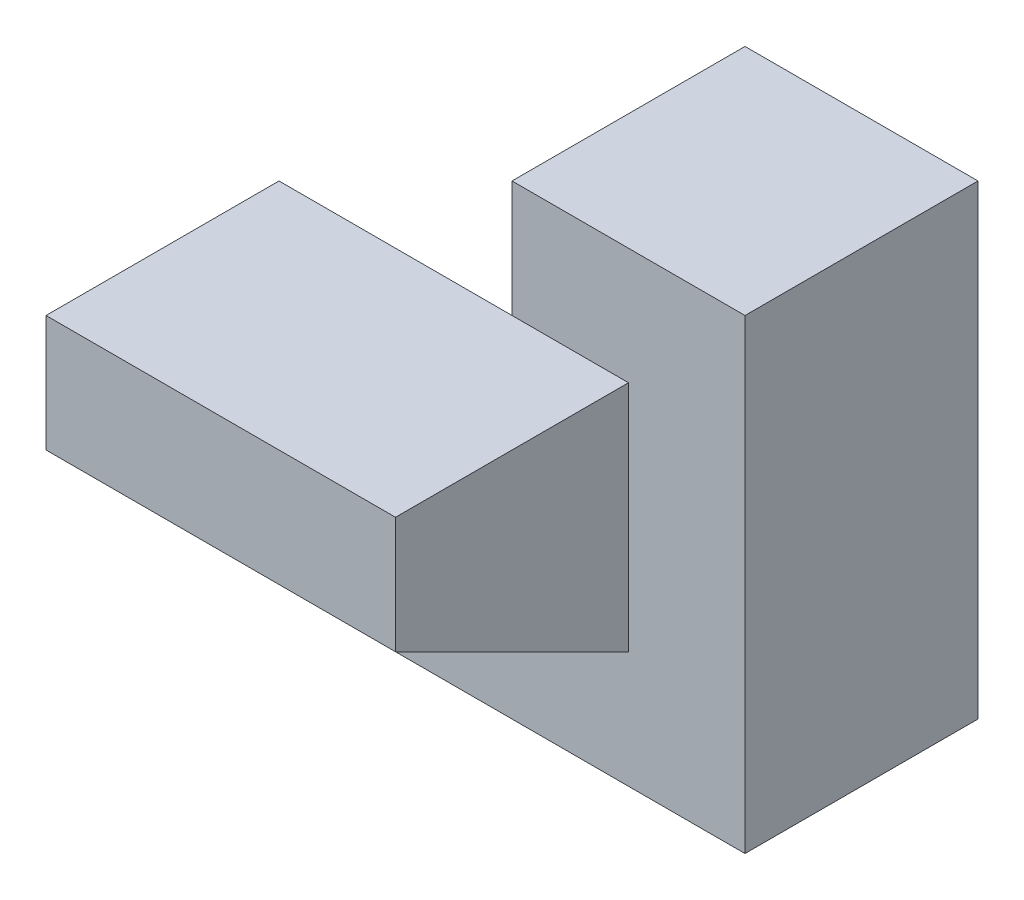
ISO-10303-21;
HEADER;
FILE_DESCRIPTION(('STEP AP214'),'2;1');
FILE_NAME('part.step','',(''),(''),'','','');
FILE_SCHEMA(('AUTOMOTIVE_DESIGN { 1 0 10303 214 1 1 1 1 }'));
ENDSEC;
DATA;
#1=APPLICATION_CONTEXT('core data for automotive mechanical design processes');
#2=APPLICATION_PROTOCOL_DEFINITION('international standard','automotive_design',2000,#1);
#3=PRODUCT_CONTEXT('',#1,'mechanical');
#4=PRODUCT('Part','Part','',(#3));
#5=PRODUCT_RELATED_PRODUCT_CATEGORY('part','',(#4));
#6=PRODUCT_DEFINITION_FORMATION('','',#4);
#7=PRODUCT_DEFINITION_CONTEXT('part definition',#1,'design');
#8=PRODUCT_DEFINITION('design','',#6,#7);
#9=PRODUCT_DEFINITION_SHAPE('','',#8);
#10=(LENGTH_UNIT() NAMED_UNIT(*) SI_UNIT(.MILLI.,.METRE.));
#11=(NAMED_UNIT(*) PLANE_ANGLE_UNIT() SI_UNIT($,.RADIAN.));
#12=(NAMED_UNIT(*) SI_UNIT($,.STERADIAN.) SOLID_ANGLE_UNIT());
#13=UNCERTAINTY_MEASURE_WITH_UNIT(LENGTH_MEASURE(1.E-05),#10,'distance_accuracy_value','');
#14=(GEOMETRIC_REPRESENTATION_CONTEXT(3) GLOBAL_UNCERTAINTY_ASSIGNED_CONTEXT((#13)) GLOBAL_UNIT_ASSIGNED_CONTEXT((#10,
#11,#12)) REPRESENTATION_CONTEXT('',''));
#15=CARTESIAN_POINT('',(0.,0.,0.));
#16=DIRECTION('',(0.,0.,1.));
#17=DIRECTION('',(1.,0.,0.));
#18=AXIS2_PLACEMENT_3D('',#15,#16,#17);
#19=CARTESIAN_POINT('',(2.,0.,0.));
#20=DIRECTION('',(0.,0.,-1.));
#21=DIRECTION('',(-1.,0.,0.));
#22=AXIS2_PLACEMENT_3D('',#19,#20,#21);
#23=PLANE('',#22);
#24=DIRECTION('',(0.,-1.,0.));
#25=VECTOR('',#24,1.);
#26=CARTESIAN_POINT('',(0.,0.,0.));
#27=LINE('',#26,#25);
#28=CARTESIAN_POINT('',(0.,4.,0.));
#29=VERTEX_POINT('',#28);
#30=CARTESIAN_POINT('',(0.,3.,0.));
#31=VERTEX_POINT('',#30);
#32=EDGE_CURVE('E104',#29,#31,#27,.T.);
#33=ORIENTED_EDGE('',*,*,#32,.T.);
#34=DIRECTION('',(-1.,0.,0.));
#35=VECTOR('',#34,1.);
#36=CARTESIAN_POINT('',(1.,3.,0.));
#37=LINE('',#36,#35);
#38=CARTESIAN_POINT('',(1.,3.,0.));
#39=VERTEX_POINT('',#38);
#40=EDGE_CURVE('E155',#39,#31,#37,.T.);
#41=ORIENTED_EDGE('',*,*,#40,.F.);
#42=DIRECTION('',(0.,1.,0.));
#43=VECTOR('',#42,1.);
#44=CARTESIAN_POINT('',(1.,0.,0.));
#45=LINE('',#44,#43);
#46=CARTESIAN_POINT('',(1.,1.,0.));
#47=VERTEX_POINT('',#46);
#48=EDGE_CURVE('E107',#47,#39,#45,.T.);
#49=ORIENTED_EDGE('',*,*,#48,.F.);
#50=DIRECTION('',(-1.,0.,0.));
#51=VECTOR('',#50,1.);
#52=CARTESIAN_POINT('',(1.,1.,0.));
#53=LINE('',#52,#51);
#54=CARTESIAN_POINT('',(-2.,1.,0.));
#55=VERTEX_POINT('',#54);
#56=EDGE_CURVE('E126',#47,#55,#53,.T.);
#57=ORIENTED_EDGE('',*,*,#56,.T.);
#58=DIRECTION('',(0.,1.,0.));
#59=VECTOR('',#58,1.);
#60=CARTESIAN_POINT('',(-2.,1.,0.));
#61=LINE('',#60,#59);
#62=CARTESIAN_POINT('',(-2.,0.,0.));
#63=VERTEX_POINT('',#62);
#64=EDGE_CURVE('E123',#63,#55,#61,.T.);
#65=ORIENTED_EDGE('',*,*,#64,.F.);
#66=DIRECTION('',(-1.,0.,0.));
#67=VECTOR('',#66,1.);
#68=CARTESIAN_POINT('',(2.,0.,0.));
#69=LINE('',#68,#67);
#70=CARTESIAN_POINT('',(2.,0.,0.));
#71=VERTEX_POINT('',#70);
#72=EDGE_CURVE('E41',#71,#63,#69,.T.);
#73=ORIENTED_EDGE('',*,*,#72,.F.);
#74=DIRECTION('',(0.,-1.,0.));
#75=VECTOR('',#74,1.);
#76=CARTESIAN_POINT('',(2.,0.,0.));
#77=LINE('',#76,#75);
#78=CARTESIAN_POINT('',(2.,4.,0.));
#79=VERTEX_POINT('',#78);
#80=EDGE_CURVE('E85',#79,#71,#77,.T.);
#81=ORIENTED_EDGE('',*,*,#80,.F.);
#82=DIRECTION('',(-1.,0.,0.));
#83=VECTOR('',#82,1.);
#84=CARTESIAN_POINT('',(2.,4.,0.));
#85=LINE('',#84,#83);
#86=EDGE_CURVE('E100',#79,#29,#85,.T.);
#87=ORIENTED_EDGE('',*,*,#86,.T.);
#88=EDGE_LOOP('',(#33,#41,#49,#57,#65,#73,#81,#87));
#89=FACE_BOUND('',#88,.T.);
#90=ADVANCED_FACE('F33',(#89),#23,.F.);
#91=CARTESIAN_POINT('',(2.,0.,0.));
#92=DIRECTION('',(0.,1.,0.));
#93=DIRECTION('',(0.,0.,1.));
#94=AXIS2_PLACEMENT_3D('',#91,#92,#93);
#95=PLANE('',#94);
#96=DIRECTION('',(-1.,0.,0.));
#97=VECTOR('',#96,1.);
#98=CARTESIAN_POINT('',(1.,0.,-2.));
#99=LINE('',#98,#97);
#100=CARTESIAN_POINT('',(0.,0.,-2.));
#101=VERTEX_POINT('',#100);
#102=CARTESIAN_POINT('',(-2.,0.,-2.));
#103=VERTEX_POINT('',#102);
#104=EDGE_CURVE('E95',#101,#103,#99,.T.);
#105=ORIENTED_EDGE('',*,*,#104,.F.);
#106=DIRECTION('',(-1.,0.,0.));
#107=VECTOR('',#106,1.);
#108=CARTESIAN_POINT('',(2.,0.,-2.));
#109=LINE('',#108,#107);
#110=CARTESIAN_POINT('',(2.,0.,-2.));
#111=VERTEX_POINT('',#110);
#112=EDGE_CURVE('E91',#111,#101,#109,.T.);
#113=ORIENTED_EDGE('',*,*,#112,.F.);
#114=DIRECTION('',(0.,0.,-1.));
#115=VECTOR('',#114,1.);
#116=CARTESIAN_POINT('',(2.,0.,0.));
#117=LINE('',#116,#115);
#118=EDGE_CURVE('E79',#71,#111,#117,.T.);
#119=ORIENTED_EDGE('',*,*,#118,.F.);
#120=ORIENTED_EDGE('',*,*,#72,.T.);
#121=DIRECTION('',(0.,0.,1.));
#122=VECTOR('',#121,1.);
#123=CARTESIAN_POINT('',(-2.,0.,0.));
#124=LINE('',#123,#122);
#125=EDGE_CURVE('E117',#103,#63,#124,.T.);
#126=ORIENTED_EDGE('',*,*,#125,.F.);
#127=EDGE_LOOP('',(#105,#113,#119,#120,#126));
#128=FACE_BOUND('',#127,.T.);
#129=ADVANCED_FACE('F92',(#128),#95,.F.);
#130=CARTESIAN_POINT('',(2.,0.,-2.));
#131=DIRECTION('',(0.,0.,1.));
#132=DIRECTION('',(1.,0.,0.));
#133=AXIS2_PLACEMENT_3D('',#130,#131,#132);
#134=PLANE('',#133);
#135=DIRECTION('',(0.,1.,0.));
#136=VECTOR('',#135,1.);
#137=CARTESIAN_POINT('',(0.,0.,-2.));
#138=LINE('',#137,#136);
#139=CARTESIAN_POINT('',(0.,4.,-2.));
#140=VERTEX_POINT('',#139);
#141=EDGE_CURVE('E61',#101,#140,#138,.T.);
#142=ORIENTED_EDGE('',*,*,#141,.T.);
#143=DIRECTION('',(-1.,0.,0.));
#144=VECTOR('',#143,1.);
#145=CARTESIAN_POINT('',(2.,4.,-2.));
#146=LINE('',#145,#144);
#147=CARTESIAN_POINT('',(2.,4.,-2.));
#148=VERTEX_POINT('',#147);
#149=EDGE_CURVE('E96',#148,#140,#146,.T.);
#150=ORIENTED_EDGE('',*,*,#149,.F.);
#151=DIRECTION('',(0.,1.,0.));
#152=VECTOR('',#151,1.);
#153=CARTESIAN_POINT('',(2.,0.,-2.));
#154=LINE('',#153,#152);
#155=EDGE_CURVE('E83',#111,#148,#154,.T.);
#156=ORIENTED_EDGE('',*,*,#155,.F.);
#157=ORIENTED_EDGE('',*,*,#112,.T.);
#158=EDGE_LOOP('',(#142,#150,#156,#157));
#159=FACE_BOUND('',#158,.T.);
#160=ADVANCED_FACE('F98',(#159),#134,.F.);
#161=CARTESIAN_POINT('',(2.,4.,0.));
#162=DIRECTION('',(0.,-1.,0.));
#163=DIRECTION('',(0.,0.,-1.));
#164=AXIS2_PLACEMENT_3D('',#161,#162,#163);
#165=PLANE('',#164);
#166=DIRECTION('',(0.,0.,1.));
#167=VECTOR('',#166,1.);
#168=CARTESIAN_POINT('',(0.,4.,0.));
#169=LINE('',#168,#167);
#170=EDGE_CURVE('E109',#140,#29,#169,.T.);
#171=ORIENTED_EDGE('',*,*,#170,.T.);
#172=ORIENTED_EDGE('',*,*,#86,.F.);
#173=DIRECTION('',(0.,0.,1.));
#174=VECTOR('',#173,1.);
#175=CARTESIAN_POINT('',(2.,4.,0.));
#176=LINE('',#175,#174);
#177=EDGE_CURVE('E49',#148,#79,#176,.T.);
#178=ORIENTED_EDGE('',*,*,#177,.F.);
#179=ORIENTED_EDGE('',*,*,#149,.T.);
#180=EDGE_LOOP('',(#171,#172,#178,#179));
#181=FACE_BOUND('',#180,.T.);
#182=ADVANCED_FACE('F217',(#181),#165,.F.);
#183=CARTESIAN_POINT('',(2.,0.,0.));
#184=DIRECTION('',(-1.,0.,0.));
#185=DIRECTION('',(0.,0.,1.));
#186=AXIS2_PLACEMENT_3D('',#183,#184,#185);
#187=PLANE('',#186);
#188=ORIENTED_EDGE('',*,*,#80,.T.);
#189=ORIENTED_EDGE('',*,*,#118,.T.);
#190=ORIENTED_EDGE('',*,*,#155,.T.);
#191=ORIENTED_EDGE('',*,*,#177,.T.);
#192=EDGE_LOOP('',(#188,#189,#190,#191));
#193=FACE_BOUND('',#192,.T.);
#194=ADVANCED_FACE('F81',(#193),#187,.F.);
#195=CARTESIAN_POINT('',(0.,0.,0.));
#196=DIRECTION('',(-1.,0.,0.));
#197=DIRECTION('',(0.,0.,1.));
#198=AXIS2_PLACEMENT_3D('',#195,#196,#197);
#199=PLANE('',#198);
#200=DIRECTION('',(0.,-0.832050294337844,-0.554700196225229));
#201=VECTOR('',#200,1.);
#202=CARTESIAN_POINT('',(0.,0.923076923076923,-1.38461538461539));
#203=LINE('',#202,#201);
#204=EDGE_CURVE('E11',#31,#101,#203,.T.);
#205=ORIENTED_EDGE('',*,*,#204,.F.);
#206=ORIENTED_EDGE('',*,*,#32,.F.);
#207=ORIENTED_EDGE('',*,*,#170,.F.);
#208=ORIENTED_EDGE('',*,*,#141,.F.);
#209=EDGE_LOOP('',(#205,#206,#207,#208));
#210=FACE_BOUND('',#209,.T.);
#211=ADVANCED_FACE('F181',(#210),#199,.T.);
#212=CARTESIAN_POINT('',(1.,0.,0.));
#213=DIRECTION('',(-1.,0.,0.));
#214=DIRECTION('',(0.,0.,1.));
#215=AXIS2_PLACEMENT_3D('',#212,#213,#214);
#216=PLANE('',#215);
#217=DIRECTION('',(0.,0.447213595499958,0.894427190999916));
#218=VECTOR('',#217,1.);
#219=CARTESIAN_POINT('',(1.,2.,2.));
#220=LINE('',#219,#218);
#221=CARTESIAN_POINT('',(1.,2.,2.));
#222=VERTEX_POINT('',#221);
#223=EDGE_CURVE('E145',#47,#222,#220,.T.);
#224=ORIENTED_EDGE('',*,*,#223,.F.);
#225=ORIENTED_EDGE('',*,*,#48,.T.);
#226=DIRECTION('',(0.,0.,-1.));
#227=VECTOR('',#226,1.);
#228=CARTESIAN_POINT('',(1.,3.,0.));
#229=LINE('',#228,#227);
#230=CARTESIAN_POINT('',(1.,3.,2.));
#231=VERTEX_POINT('',#230);
#232=EDGE_CURVE('E151',#231,#39,#229,.T.);
#233=ORIENTED_EDGE('',*,*,#232,.F.);
#234=DIRECTION('',(0.,1.,0.));
#235=VECTOR('',#234,1.);
#236=CARTESIAN_POINT('',(1.,3.,2.));
#237=LINE('',#236,#235);
#238=EDGE_CURVE('E148',#222,#231,#237,.T.);
#239=ORIENTED_EDGE('',*,*,#238,.F.);
#240=EDGE_LOOP('',(#224,#225,#233,#239));
#241=FACE_BOUND('',#240,.T.);
#242=ADVANCED_FACE('F168',(#241),#216,.F.);
#243=CARTESIAN_POINT('',(1.,0.,-2.));
#244=DIRECTION('',(0.,0.554700196225229,-0.832050294337844));
#245=DIRECTION('',(0.,0.832050294337844,0.554700196225229));
#246=AXIS2_PLACEMENT_3D('',#243,#244,#245);
#247=PLANE('',#246);
#248=CARTESIAN_POINT('',(-2.,3.,0.));
#249=VERTEX_POINT('',#248);
#250=EDGE_CURVE('E71',#31,#249,#37,.T.);
#251=ORIENTED_EDGE('',*,*,#250,.F.);
#252=ORIENTED_EDGE('',*,*,#204,.T.);
#253=ORIENTED_EDGE('',*,*,#104,.T.);
#254=DIRECTION('',(0.,-0.832050294337844,-0.554700196225229));
#255=VECTOR('',#254,1.);
#256=CARTESIAN_POINT('',(-2.,0.,-2.));
#257=LINE('',#256,#255);
#258=EDGE_CURVE('E135',#249,#103,#257,.T.);
#259=ORIENTED_EDGE('',*,*,#258,.F.);
#260=EDGE_LOOP('',(#251,#252,#253,#259));
#261=FACE_BOUND('',#260,.T.);
#262=ADVANCED_FACE('F182',(#261),#247,.T.);
#263=CARTESIAN_POINT('',(1.,3.,0.));
#264=DIRECTION('',(0.,1.,0.));
#265=DIRECTION('',(0.,0.,1.));
#266=AXIS2_PLACEMENT_3D('',#263,#264,#265);
#267=PLANE('',#266);
#268=ORIENTED_EDGE('',*,*,#40,.T.);
#269=ORIENTED_EDGE('',*,*,#250,.T.);
#270=DIRECTION('',(0.,0.,-1.));
#271=VECTOR('',#270,1.);
#272=CARTESIAN_POINT('',(-2.,3.,0.));
#273=LINE('',#272,#271);
#274=CARTESIAN_POINT('',(-2.,3.,2.));
#275=VERTEX_POINT('',#274);
#276=EDGE_CURVE('E142',#275,#249,#273,.T.);
#277=ORIENTED_EDGE('',*,*,#276,.F.);
#278=DIRECTION('',(-1.,0.,0.));
#279=VECTOR('',#278,1.);
#280=CARTESIAN_POINT('',(1.,3.,2.));
#281=LINE('',#280,#279);
#282=EDGE_CURVE('E157',#231,#275,#281,.T.);
#283=ORIENTED_EDGE('',*,*,#282,.F.);
#284=ORIENTED_EDGE('',*,*,#232,.T.);
#285=EDGE_LOOP('',(#268,#269,#277,#283,#284));
#286=FACE_BOUND('',#285,.T.);
#287=ADVANCED_FACE('F175',(#286),#267,.T.);
#288=CARTESIAN_POINT('',(1.,3.,2.));
#289=DIRECTION('',(0.,0.,1.));
#290=DIRECTION('',(1.,0.,0.));
#291=AXIS2_PLACEMENT_3D('',#288,#289,#290);
#292=PLANE('',#291);
#293=ORIENTED_EDGE('',*,*,#282,.T.);
#294=DIRECTION('',(0.,1.,0.));
#295=VECTOR('',#294,1.);
#296=CARTESIAN_POINT('',(-2.,3.,2.));
#297=LINE('',#296,#295);
#298=CARTESIAN_POINT('',(-2.,2.,2.));
#299=VERTEX_POINT('',#298);
#300=EDGE_CURVE('E139',#299,#275,#297,.T.);
#301=ORIENTED_EDGE('',*,*,#300,.F.);
#302=DIRECTION('',(-1.,0.,0.));
#303=VECTOR('',#302,1.);
#304=CARTESIAN_POINT('',(1.,2.,2.));
#305=LINE('',#304,#303);
#306=EDGE_CURVE('E160',#222,#299,#305,.T.);
#307=ORIENTED_EDGE('',*,*,#306,.F.);
#308=ORIENTED_EDGE('',*,*,#238,.T.);
#309=EDGE_LOOP('',(#293,#301,#307,#308));
#310=FACE_BOUND('',#309,.T.);
#311=ADVANCED_FACE('F195',(#310),#292,.T.);
#312=CARTESIAN_POINT('',(1.,2.,2.));
#313=DIRECTION('',(0.,-0.894427190999916,0.447213595499958));
#314=DIRECTION('',(0.,-0.447213595499958,-0.894427190999916));
#315=AXIS2_PLACEMENT_3D('',#312,#313,#314);
#316=PLANE('',#315);
#317=ORIENTED_EDGE('',*,*,#306,.T.);
#318=DIRECTION('',(0.,0.447213595499958,0.894427190999916));
#319=VECTOR('',#318,1.);
#320=CARTESIAN_POINT('',(-2.,2.,2.));
#321=LINE('',#320,#319);
#322=EDGE_CURVE('E130',#55,#299,#321,.T.);
#323=ORIENTED_EDGE('',*,*,#322,.F.);
#324=ORIENTED_EDGE('',*,*,#56,.F.);
#325=ORIENTED_EDGE('',*,*,#223,.T.);
#326=EDGE_LOOP('',(#317,#323,#324,#325));
#327=FACE_BOUND('',#326,.T.);
#328=ADVANCED_FACE('F198',(#327),#316,.T.);
#329=CARTESIAN_POINT('',(-2.,0.,0.));
#330=DIRECTION('',(-1.,0.,0.));
#331=DIRECTION('',(0.,0.,1.));
#332=AXIS2_PLACEMENT_3D('',#329,#330,#331);
#333=PLANE('',#332);
#334=ORIENTED_EDGE('',*,*,#125,.T.);
#335=ORIENTED_EDGE('',*,*,#64,.T.);
#336=ORIENTED_EDGE('',*,*,#322,.T.);
#337=ORIENTED_EDGE('',*,*,#300,.T.);
#338=ORIENTED_EDGE('',*,*,#276,.T.);
#339=ORIENTED_EDGE('',*,*,#258,.T.);
#340=EDGE_LOOP('',(#334,#335,#336,#337,#338,#339));
#341=FACE_BOUND('',#340,.T.);
#342=ADVANCED_FACE('F133',(#341),#333,.T.);
#343=CLOSED_SHELL('',(#90,#129,#160,#182,#194,#211,#242,#262,#287,#311,#328,#342));
#344=MANIFOLD_SOLID_BREP('B2',#343);
#345=ADVANCED_BREP_SHAPE_REPRESENTATION('',(#18,#344),#14);
#346=SHAPE_DEFINITION_REPRESENTATION(#9,#345);
ENDSEC;
END-ISO-10303-21;
